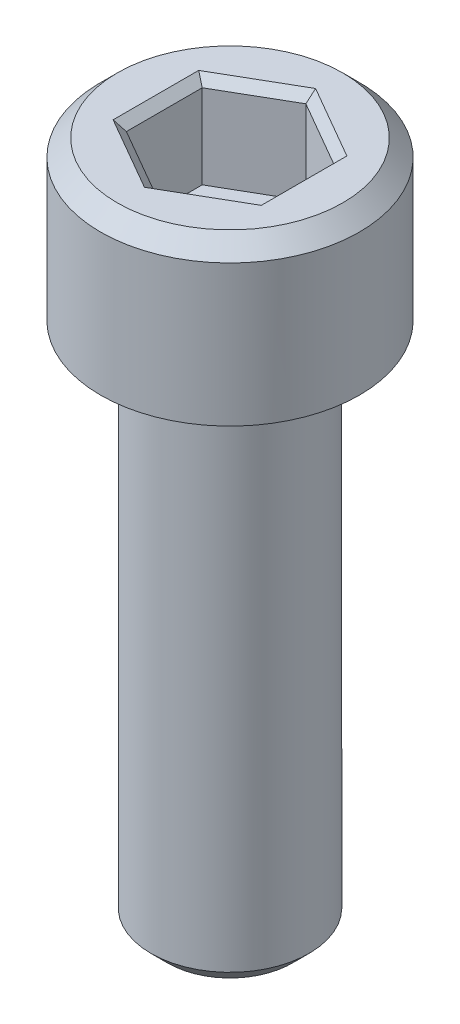
ISO-10303-21;
HEADER;
FILE_DESCRIPTION(('STEP AP214'),'2;1');
FILE_NAME('part.step','',(''),(''),'','','');
FILE_SCHEMA(('AUTOMOTIVE_DESIGN { 1 0 10303 214 1 1 1 1 }'));
ENDSEC;
DATA;
#1=APPLICATION_CONTEXT('core data for automotive mechanical design processes');
#2=APPLICATION_PROTOCOL_DEFINITION('international standard','automotive_design',2000,#1);
#3=PRODUCT_CONTEXT('',#1,'mechanical');
#4=PRODUCT('Part','Part','',(#3));
#5=PRODUCT_RELATED_PRODUCT_CATEGORY('part','',(#4));
#6=PRODUCT_DEFINITION_FORMATION('','',#4);
#7=PRODUCT_DEFINITION_CONTEXT('part definition',#1,'design');
#8=PRODUCT_DEFINITION('design','',#6,#7);
#9=PRODUCT_DEFINITION_SHAPE('','',#8);
#10=(LENGTH_UNIT() NAMED_UNIT(*) SI_UNIT(.MILLI.,.METRE.));
#11=(NAMED_UNIT(*) PLANE_ANGLE_UNIT() SI_UNIT($,.RADIAN.));
#12=(NAMED_UNIT(*) SI_UNIT($,.STERADIAN.) SOLID_ANGLE_UNIT());
#13=UNCERTAINTY_MEASURE_WITH_UNIT(LENGTH_MEASURE(1.E-05),#10,'distance_accuracy_value','');
#14=(GEOMETRIC_REPRESENTATION_CONTEXT(3) GLOBAL_UNCERTAINTY_ASSIGNED_CONTEXT((#13)) GLOBAL_UNIT_ASSIGNED_CONTEXT((#10,
#11,#12)) REPRESENTATION_CONTEXT('',''));
#15=CARTESIAN_POINT('',(0.,0.,0.));
#16=DIRECTION('',(0.,0.,1.));
#17=DIRECTION('',(1.,0.,0.));
#18=AXIS2_PLACEMENT_3D('',#15,#16,#17);
#19=CARTESIAN_POINT('',(0.,0.,0.));
#20=DIRECTION('',(0.,1.,0.));
#21=DIRECTION('',(0.,0.,1.));
#22=AXIS2_PLACEMENT_3D('',#19,#20,#21);
#23=PLANE('',#22);
#24=DIRECTION('',(0.,0.,1.));
#25=VECTOR('',#24,1.);
#26=CARTESIAN_POINT('',(2.23837500000001,0.,0.));
#27=LINE('',#26,#25);
#28=CARTESIAN_POINT('',(2.23837500000001,0.,-1.29232640879732));
#29=VERTEX_POINT('',#28);
#30=CARTESIAN_POINT('',(2.23837500000001,0.,1.29232640879733));
#31=VERTEX_POINT('',#30);
#32=EDGE_CURVE('E155',#29,#31,#27,.T.);
#33=ORIENTED_EDGE('',*,*,#32,.T.);
#34=DIRECTION('',(-0.866025403784439,0.,0.5));
#35=VECTOR('',#34,1.);
#36=CARTESIAN_POINT('',(1.11918750000001,0.,1.938489613196));
#37=LINE('',#36,#35);
#38=CARTESIAN_POINT('',(0.,0.,2.58465281759467));
#39=VERTEX_POINT('',#38);
#40=EDGE_CURVE('E158',#31,#39,#37,.T.);
#41=ORIENTED_EDGE('',*,*,#40,.T.);
#42=DIRECTION('',(-0.866025403784439,0.,-0.5));
#43=VECTOR('',#42,1.);
#44=CARTESIAN_POINT('',(-1.1191875,0.,1.938489613196));
#45=LINE('',#44,#43);
#46=CARTESIAN_POINT('',(-2.23837499999999,0.,1.29232640879733));
#47=VERTEX_POINT('',#46);
#48=EDGE_CURVE('E146',#39,#47,#45,.T.);
#49=ORIENTED_EDGE('',*,*,#48,.T.);
#50=DIRECTION('',(0.,0.,-1.));
#51=VECTOR('',#50,1.);
#52=CARTESIAN_POINT('',(-2.23837499999999,0.,0.));
#53=LINE('',#52,#51);
#54=CARTESIAN_POINT('',(-2.23837499999999,0.,-1.29232640879732));
#55=VERTEX_POINT('',#54);
#56=EDGE_CURVE('E143',#47,#55,#53,.T.);
#57=ORIENTED_EDGE('',*,*,#56,.T.);
#58=DIRECTION('',(0.866025403784438,0.,-0.5));
#59=VECTOR('',#58,1.);
#60=CARTESIAN_POINT('',(-1.11918749999999,0.,-1.93848961319599));
#61=LINE('',#60,#59);
#62=CARTESIAN_POINT('',(0.,0.,-2.58465281759465));
#63=VERTEX_POINT('',#62);
#64=EDGE_CURVE('E149',#55,#63,#61,.T.);
#65=ORIENTED_EDGE('',*,*,#64,.T.);
#66=DIRECTION('',(0.866025403784439,0.,0.5));
#67=VECTOR('',#66,1.);
#68=CARTESIAN_POINT('',(1.1191875,0.,-1.93848961319599));
#69=LINE('',#68,#67);
#70=EDGE_CURVE('E152',#63,#29,#69,.T.);
#71=ORIENTED_EDGE('',*,*,#70,.T.);
#72=EDGE_LOOP('',(#33,#41,#49,#57,#65,#71));
#73=FACE_BOUND('',#72,.T.);
#74=CARTESIAN_POINT('',(0.,0.,0.));
#75=DIRECTION('',(0.,1.,0.));
#76=DIRECTION('',(0.,0.,1.));
#77=AXIS2_PLACEMENT_3D('',#74,#75,#76);
#78=CIRCLE('',#77,3.4036);
#79=CARTESIAN_POINT('',(0.,0.,3.4036));
#80=VERTEX_POINT('',#79);
#81=EDGE_CURVE('E128',#80,#80,#78,.T.);
#82=ORIENTED_EDGE('',*,*,#81,.T.);
#83=EDGE_LOOP('',(#82));
#84=FACE_BOUND('',#83,.T.);
#85=ADVANCED_FACE('F16',(#73,#84),#23,.T.);
#86=CARTESIAN_POINT('',(0.,-4.77520000000009,0.));
#87=DIRECTION('',(0.,1.,0.));
#88=DIRECTION('',(0.,0.,1.));
#89=AXIS2_PLACEMENT_3D('',#86,#87,#88);
#90=CYLINDRICAL_SURFACE('',#89,3.9116);
#91=CARTESIAN_POINT('',(0.,-0.507999999999953,0.));
#92=DIRECTION('',(0.,1.,0.));
#93=DIRECTION('',(0.,0.,1.));
#94=AXIS2_PLACEMENT_3D('',#91,#92,#93);
#95=CIRCLE('',#94,3.9116);
#96=CARTESIAN_POINT('',(0.,-0.507999999999953,3.9116));
#97=VERTEX_POINT('',#96);
#98=EDGE_CURVE('E132',#97,#97,#95,.F.);
#99=ORIENTED_EDGE('',*,*,#98,.T.);
#100=EDGE_LOOP('',(#99));
#101=FACE_BOUND('',#100,.T.);
#102=CARTESIAN_POINT('',(0.,-4.77520000000009,0.));
#103=DIRECTION('',(0.,1.,0.));
#104=DIRECTION('',(1.,0.,0.));
#105=AXIS2_PLACEMENT_3D('',#102,#103,#104);
#106=CIRCLE('',#105,3.9116);
#107=CARTESIAN_POINT('',(3.9116,-4.77520000000009,0.));
#108=VERTEX_POINT('',#107);
#109=EDGE_CURVE('E118',#108,#108,#106,.T.);
#110=ORIENTED_EDGE('',*,*,#109,.T.);
#111=EDGE_LOOP('',(#110));
#112=FACE_BOUND('',#111,.T.);
#113=ADVANCED_FACE('F18',(#101,#112),#90,.T.);
#114=CARTESIAN_POINT('',(0.,-4.77520000000009,0.));
#115=DIRECTION('',(0.,1.,0.));
#116=DIRECTION('',(0.,0.,1.));
#117=AXIS2_PLACEMENT_3D('',#114,#115,#116);
#118=PLANE('',#117);
#119=CARTESIAN_POINT('',(0.,-4.77520000000009,0.));
#120=DIRECTION('',(0.,1.,0.));
#121=DIRECTION('',(1.,0.,0.));
#122=AXIS2_PLACEMENT_3D('',#119,#120,#121);
#123=CIRCLE('',#122,2.3876);
#124=CARTESIAN_POINT('',(2.3876,-4.77520000000009,0.));
#125=VERTEX_POINT('',#124);
#126=EDGE_CURVE('E110',#125,#125,#123,.T.);
#127=ORIENTED_EDGE('',*,*,#126,.T.);
#128=EDGE_LOOP('',(#127));
#129=FACE_BOUND('',#128,.T.);
#130=ORIENTED_EDGE('',*,*,#109,.F.);
#131=EDGE_LOOP('',(#130));
#132=FACE_BOUND('',#131,.T.);
#133=ADVANCED_FACE('F265',(#129,#132),#118,.F.);
#134=CARTESIAN_POINT('',(0.,-20.6502,0.));
#135=DIRECTION('',(0.,1.,0.));
#136=DIRECTION('',(0.,0.,1.));
#137=AXIS2_PLACEMENT_3D('',#134,#135,#136);
#138=CYLINDRICAL_SURFACE('',#137,2.3876);
#139=CARTESIAN_POINT('',(0.,-20.1422,0.));
#140=DIRECTION('',(0.,1.,0.));
#141=DIRECTION('',(0.,0.,1.));
#142=AXIS2_PLACEMENT_3D('',#139,#140,#141);
#143=CIRCLE('',#142,2.3876);
#144=CARTESIAN_POINT('',(0.,-20.1422,2.3876));
#145=VERTEX_POINT('',#144);
#146=EDGE_CURVE('E136',#145,#145,#143,.T.);
#147=ORIENTED_EDGE('',*,*,#146,.T.);
#148=EDGE_LOOP('',(#147));
#149=FACE_BOUND('',#148,.T.);
#150=ORIENTED_EDGE('',*,*,#126,.F.);
#151=EDGE_LOOP('',(#150));
#152=FACE_BOUND('',#151,.T.);
#153=ADVANCED_FACE('F268',(#149,#152),#138,.T.);
#154=CARTESIAN_POINT('',(0.,-20.6502,0.));
#155=DIRECTION('',(0.,1.,0.));
#156=DIRECTION('',(0.,0.,1.));
#157=AXIS2_PLACEMENT_3D('',#154,#155,#156);
#158=PLANE('',#157);
#159=CARTESIAN_POINT('',(0.,-20.6502,0.));
#160=DIRECTION('',(0.,1.,0.));
#161=DIRECTION('',(0.,0.,1.));
#162=AXIS2_PLACEMENT_3D('',#159,#160,#161);
#163=CIRCLE('',#162,1.8796);
#164=CARTESIAN_POINT('',(0.,-20.6502,1.8796));
#165=VERTEX_POINT('',#164);
#166=EDGE_CURVE('E140',#165,#165,#163,.F.);
#167=ORIENTED_EDGE('',*,*,#166,.T.);
#168=EDGE_LOOP('',(#167));
#169=FACE_BOUND('',#168,.T.);
#170=ADVANCED_FACE('F275',(#169),#158,.F.);
#171=CARTESIAN_POINT('',(0.,0.,0.));
#172=DIRECTION('',(0.,-1.,0.));
#173=DIRECTION('',(0.,0.,-1.));
#174=AXIS2_PLACEMENT_3D('',#171,#172,#173);
#175=CONICAL_SURFACE('',#174,3.4036,0.785398163397448);
#176=ORIENTED_EDGE('',*,*,#98,.F.);
#177=EDGE_LOOP('',(#176));
#178=FACE_BOUND('',#177,.T.);
#179=ORIENTED_EDGE('',*,*,#81,.F.);
#180=EDGE_LOOP('',(#179));
#181=FACE_BOUND('',#180,.T.);
#182=ADVANCED_FACE('F285',(#178,#181),#175,.T.);
#183=CARTESIAN_POINT('',(0.,-20.1422,0.));
#184=DIRECTION('',(0.,1.,0.));
#185=DIRECTION('',(0.,0.,1.));
#186=AXIS2_PLACEMENT_3D('',#183,#184,#185);
#187=CONICAL_SURFACE('',#186,2.3876,0.785398163397447);
#188=ORIENTED_EDGE('',*,*,#166,.F.);
#189=EDGE_LOOP('',(#188));
#190=FACE_BOUND('',#189,.T.);
#191=ORIENTED_EDGE('',*,*,#146,.F.);
#192=EDGE_LOOP('',(#191));
#193=FACE_BOUND('',#192,.T.);
#194=ADVANCED_FACE('F289',(#190,#193),#187,.T.);
#195=CARTESIAN_POINT('',(0.,-2.79399999999996,2.29135888084634));
#196=DIRECTION('',(0.5,0.,-0.866025403784438));
#197=DIRECTION('',(-0.866025403784438,0.,-0.5));
#198=AXIS2_PLACEMENT_3D('',#195,#196,#197);
#199=PLANE('',#198);
#200=DIRECTION('',(0.,1.,0.));
#201=VECTOR('',#200,1.);
#202=CARTESIAN_POINT('',(-1.984375,-2.79399999999996,1.14567944042317));
#203=LINE('',#202,#201);
#204=CARTESIAN_POINT('',(-1.984375,-2.79399999999996,1.14567944042317));
#205=VERTEX_POINT('',#204);
#206=CARTESIAN_POINT('',(-1.984375,-0.253999999999976,1.14567944042317));
#207=VERTEX_POINT('',#206);
#208=EDGE_CURVE('E101',#205,#207,#203,.T.);
#209=ORIENTED_EDGE('',*,*,#208,.T.);
#210=DIRECTION('',(0.866025403784438,0.,0.5));
#211=VECTOR('',#210,1.);
#212=CARTESIAN_POINT('',(0.,-0.253999999999976,2.29135888084634));
#213=LINE('',#212,#211);
#214=CARTESIAN_POINT('',(0.,-0.253999999999976,2.29135888084634));
#215=VERTEX_POINT('',#214);
#216=EDGE_CURVE('E25',#207,#215,#213,.T.);
#217=ORIENTED_EDGE('',*,*,#216,.T.);
#218=DIRECTION('',(0.,1.,0.));
#219=VECTOR('',#218,1.);
#220=CARTESIAN_POINT('',(0.,-2.79399999999996,2.29135888084634));
#221=LINE('',#220,#219);
#222=CARTESIAN_POINT('',(0.,-2.79399999999996,2.29135888084634));
#223=VERTEX_POINT('',#222);
#224=EDGE_CURVE('E104',#223,#215,#221,.T.);
#225=ORIENTED_EDGE('',*,*,#224,.F.);
#226=DIRECTION('',(-0.866025403784438,0.,-0.5));
#227=VECTOR('',#226,1.);
#228=CARTESIAN_POINT('',(0.,-2.79399999999996,2.29135888084634));
#229=LINE('',#228,#227);
#230=EDGE_CURVE('E93',#223,#205,#229,.T.);
#231=ORIENTED_EDGE('',*,*,#230,.T.);
#232=EDGE_LOOP('',(#209,#217,#225,#231));
#233=FACE_BOUND('',#232,.T.);
#234=ADVANCED_FACE('F100',(#233),#199,.T.);
#235=CARTESIAN_POINT('',(-1.984375,-2.79399999999996,1.14567944042317));
#236=DIRECTION('',(1.,0.,0.));
#237=DIRECTION('',(0.,0.,-1.));
#238=AXIS2_PLACEMENT_3D('',#235,#236,#237);
#239=PLANE('',#238);
#240=DIRECTION('',(0.,1.,0.));
#241=VECTOR('',#240,1.);
#242=CARTESIAN_POINT('',(-1.984375,-2.79399999999996,-1.14567944042316));
#243=LINE('',#242,#241);
#244=CARTESIAN_POINT('',(-1.984375,-2.79399999999996,-1.14567944042316));
#245=VERTEX_POINT('',#244);
#246=CARTESIAN_POINT('',(-1.984375,-0.253999999999976,-1.14567944042316));
#247=VERTEX_POINT('',#246);
#248=EDGE_CURVE('E111',#245,#247,#243,.T.);
#249=ORIENTED_EDGE('',*,*,#248,.T.);
#250=DIRECTION('',(0.,0.,1.));
#251=VECTOR('',#250,1.);
#252=CARTESIAN_POINT('',(-1.984375,-0.253999999999976,1.14567944042317));
#253=LINE('',#252,#251);
#254=EDGE_CURVE('E11',#247,#207,#253,.T.);
#255=ORIENTED_EDGE('',*,*,#254,.T.);
#256=ORIENTED_EDGE('',*,*,#208,.F.);
#257=DIRECTION('',(0.,0.,-1.));
#258=VECTOR('',#257,1.);
#259=CARTESIAN_POINT('',(-1.984375,-2.79399999999996,1.14567944042317));
#260=LINE('',#259,#258);
#261=EDGE_CURVE('E89',#205,#245,#260,.T.);
#262=ORIENTED_EDGE('',*,*,#261,.T.);
#263=EDGE_LOOP('',(#249,#255,#256,#262));
#264=FACE_BOUND('',#263,.T.);
#265=ADVANCED_FACE('F108',(#264),#239,.T.);
#266=CARTESIAN_POINT('',(-1.984375,-2.79399999999996,-1.14567944042316));
#267=DIRECTION('',(0.5,0.,0.866025403784438));
#268=DIRECTION('',(0.866025403784438,0.,-0.5));
#269=AXIS2_PLACEMENT_3D('',#266,#267,#268);
#270=PLANE('',#269);
#271=DIRECTION('',(0.,1.,0.));
#272=VECTOR('',#271,1.);
#273=CARTESIAN_POINT('',(0.,-2.79399999999996,-2.29135888084632));
#274=LINE('',#273,#272);
#275=CARTESIAN_POINT('',(0.,-2.79399999999996,-2.29135888084632));
#276=VERTEX_POINT('',#275);
#277=CARTESIAN_POINT('',(0.,-0.253999999999976,-2.29135888084632));
#278=VERTEX_POINT('',#277);
#279=EDGE_CURVE('E121',#276,#278,#274,.T.);
#280=ORIENTED_EDGE('',*,*,#279,.T.);
#281=DIRECTION('',(-0.866025403784438,0.,0.5));
#282=VECTOR('',#281,1.);
#283=CARTESIAN_POINT('',(-1.984375,-0.253999999999976,-1.14567944042316));
#284=LINE('',#283,#282);
#285=EDGE_CURVE('E38',#278,#247,#284,.T.);
#286=ORIENTED_EDGE('',*,*,#285,.T.);
#287=ORIENTED_EDGE('',*,*,#248,.F.);
#288=DIRECTION('',(0.866025403784438,0.,-0.5));
#289=VECTOR('',#288,1.);
#290=CARTESIAN_POINT('',(-1.984375,-2.79399999999996,-1.14567944042316));
#291=LINE('',#290,#289);
#292=EDGE_CURVE('E95',#245,#276,#291,.T.);
#293=ORIENTED_EDGE('',*,*,#292,.T.);
#294=EDGE_LOOP('',(#280,#286,#287,#293));
#295=FACE_BOUND('',#294,.T.);
#296=ADVANCED_FACE('F231',(#295),#270,.T.);
#297=CARTESIAN_POINT('',(0.,-2.79399999999996,-2.29135888084632));
#298=DIRECTION('',(-0.5,0.,0.866025403784438));
#299=DIRECTION('',(0.866025403784439,0.,0.5));
#300=AXIS2_PLACEMENT_3D('',#297,#298,#299);
#301=PLANE('',#300);
#302=DIRECTION('',(0.,1.,0.));
#303=VECTOR('',#302,1.);
#304=CARTESIAN_POINT('',(1.98437500000001,-2.79399999999996,-1.14567944042316));
#305=LINE('',#304,#303);
#306=CARTESIAN_POINT('',(1.98437500000001,-2.79399999999996,-1.14567944042316));
#307=VERTEX_POINT('',#306);
#308=CARTESIAN_POINT('',(1.98437500000001,-0.253999999999976,-1.14567944042316));
#309=VERTEX_POINT('',#308);
#310=EDGE_CURVE('E226',#307,#309,#305,.T.);
#311=ORIENTED_EDGE('',*,*,#310,.T.);
#312=DIRECTION('',(-0.866025403784439,0.,-0.5));
#313=VECTOR('',#312,1.);
#314=CARTESIAN_POINT('',(0.,-0.253999999999976,-2.29135888084632));
#315=LINE('',#314,#313);
#316=EDGE_CURVE('E169',#309,#278,#315,.T.);
#317=ORIENTED_EDGE('',*,*,#316,.T.);
#318=ORIENTED_EDGE('',*,*,#279,.F.);
#319=DIRECTION('',(0.866025403784439,0.,0.5));
#320=VECTOR('',#319,1.);
#321=CARTESIAN_POINT('',(0.,-2.79399999999996,-2.29135888084632));
#322=LINE('',#321,#320);
#323=EDGE_CURVE('E216',#276,#307,#322,.T.);
#324=ORIENTED_EDGE('',*,*,#323,.T.);
#325=EDGE_LOOP('',(#311,#317,#318,#324));
#326=FACE_BOUND('',#325,.T.);
#327=ADVANCED_FACE('F306',(#326),#301,.T.);
#328=CARTESIAN_POINT('',(1.98437500000001,-2.79399999999996,-1.14567944042316));
#329=DIRECTION('',(-1.,0.,0.));
#330=DIRECTION('',(0.,0.,1.));
#331=AXIS2_PLACEMENT_3D('',#328,#329,#330);
#332=PLANE('',#331);
#333=DIRECTION('',(0.,1.,0.));
#334=VECTOR('',#333,1.);
#335=CARTESIAN_POINT('',(1.98437500000001,-2.79399999999996,1.14567944042317));
#336=LINE('',#335,#334);
#337=CARTESIAN_POINT('',(1.98437500000001,-2.79399999999996,1.14567944042317));
#338=VERTEX_POINT('',#337);
#339=CARTESIAN_POINT('',(1.98437500000001,-0.253999999999976,1.14567944042317));
#340=VERTEX_POINT('',#339);
#341=EDGE_CURVE('E185',#338,#340,#336,.T.);
#342=ORIENTED_EDGE('',*,*,#341,.T.);
#343=DIRECTION('',(0.,0.,-1.));
#344=VECTOR('',#343,1.);
#345=CARTESIAN_POINT('',(1.98437500000001,-0.253999999999976,-1.14567944042316));
#346=LINE('',#345,#344);
#347=EDGE_CURVE('E166',#340,#309,#346,.T.);
#348=ORIENTED_EDGE('',*,*,#347,.T.);
#349=ORIENTED_EDGE('',*,*,#310,.F.);
#350=DIRECTION('',(0.,0.,1.));
#351=VECTOR('',#350,1.);
#352=CARTESIAN_POINT('',(1.98437500000001,-2.79399999999996,-1.14567944042316));
#353=LINE('',#352,#351);
#354=EDGE_CURVE('E219',#307,#338,#353,.T.);
#355=ORIENTED_EDGE('',*,*,#354,.T.);
#356=EDGE_LOOP('',(#342,#348,#349,#355));
#357=FACE_BOUND('',#356,.T.);
#358=ADVANCED_FACE('F309',(#357),#332,.T.);
#359=CARTESIAN_POINT('',(1.98437500000001,-2.79399999999996,1.14567944042317));
#360=DIRECTION('',(-0.5,0.,-0.866025403784438));
#361=DIRECTION('',(-0.866025403784439,0.,0.5));
#362=AXIS2_PLACEMENT_3D('',#359,#360,#361);
#363=PLANE('',#362);
#364=ORIENTED_EDGE('',*,*,#224,.T.);
#365=DIRECTION('',(0.866025403784439,0.,-0.5));
#366=VECTOR('',#365,1.);
#367=CARTESIAN_POINT('',(1.98437500000001,-0.253999999999976,1.14567944042317));
#368=LINE('',#367,#366);
#369=EDGE_CURVE('E162',#215,#340,#368,.T.);
#370=ORIENTED_EDGE('',*,*,#369,.T.);
#371=ORIENTED_EDGE('',*,*,#341,.F.);
#372=DIRECTION('',(-0.866025403784439,0.,0.5));
#373=VECTOR('',#372,1.);
#374=CARTESIAN_POINT('',(1.98437500000001,-2.79399999999996,1.14567944042317));
#375=LINE('',#374,#373);
#376=EDGE_CURVE('E184',#338,#223,#375,.T.);
#377=ORIENTED_EDGE('',*,*,#376,.T.);
#378=EDGE_LOOP('',(#364,#370,#371,#377));
#379=FACE_BOUND('',#378,.T.);
#380=ADVANCED_FACE('F181',(#379),#363,.T.);
#381=CARTESIAN_POINT('',(-3.96874999999999,-2.79399999999996,0.));
#382=DIRECTION('',(0.,-1.,0.));
#383=DIRECTION('',(0.,0.,-1.));
#384=AXIS2_PLACEMENT_3D('',#381,#382,#383);
#385=PLANE('',#384);
#386=ORIENTED_EDGE('',*,*,#230,.F.);
#387=ORIENTED_EDGE('',*,*,#376,.F.);
#388=ORIENTED_EDGE('',*,*,#354,.F.);
#389=ORIENTED_EDGE('',*,*,#323,.F.);
#390=ORIENTED_EDGE('',*,*,#292,.F.);
#391=ORIENTED_EDGE('',*,*,#261,.F.);
#392=EDGE_LOOP('',(#386,#387,#388,#389,#390,#391));
#393=FACE_BOUND('',#392,.T.);
#394=ADVANCED_FACE('F91',(#393),#385,.F.);
#395=CARTESIAN_POINT('',(-1.11918749999999,0.,-1.93848961319599));
#396=DIRECTION('',(-0.353553390593274,-0.707106781186548,-0.612372435695794));
#397=DIRECTION('',(0.,0.654653670707977,-0.755928946018455));
#398=AXIS2_PLACEMENT_3D('',#395,#396,#397);
#399=PLANE('',#398);
#400=DIRECTION('',(-0.654653670707977,0.654653670707977,-0.377964473009228));
#401=VECTOR('',#400,1.);
#402=CARTESIAN_POINT('',(-1.91860714285714,-0.319767857142939,-1.1077083503977));
#403=LINE('',#402,#401);
#404=EDGE_CURVE('E209',#247,#55,#403,.T.);
#405=ORIENTED_EDGE('',*,*,#404,.F.);
#406=ORIENTED_EDGE('',*,*,#285,.F.);
#407=DIRECTION('',(0.,0.654653670707977,-0.755928946018455));
#408=VECTOR('',#407,1.);
#409=CARTESIAN_POINT('',(0.,-0.319767857142939,-2.21541670079541));
#410=LINE('',#409,#408);
#411=EDGE_CURVE('E106',#63,#278,#410,.F.);
#412=ORIENTED_EDGE('',*,*,#411,.F.);
#413=ORIENTED_EDGE('',*,*,#64,.F.);
#414=EDGE_LOOP('',(#405,#406,#412,#413));
#415=FACE_BOUND('',#414,.T.);
#416=ADVANCED_FACE('F236',(#415),#399,.F.);
#417=CARTESIAN_POINT('',(1.1191875,0.,-1.93848961319599));
#418=DIRECTION('',(0.353553390593274,-0.707106781186548,-0.612372435695794));
#419=DIRECTION('',(0.,0.654653670707977,-0.755928946018455));
#420=AXIS2_PLACEMENT_3D('',#417,#418,#419);
#421=PLANE('',#420);
#422=ORIENTED_EDGE('',*,*,#411,.T.);
#423=ORIENTED_EDGE('',*,*,#316,.F.);
#424=DIRECTION('',(0.654653670707977,0.654653670707977,-0.377964473009228));
#425=VECTOR('',#424,1.);
#426=CARTESIAN_POINT('',(1.91860714285715,-0.319767857142939,-1.1077083503977));
#427=LINE('',#426,#425);
#428=EDGE_CURVE('E205',#29,#309,#427,.F.);
#429=ORIENTED_EDGE('',*,*,#428,.F.);
#430=ORIENTED_EDGE('',*,*,#70,.F.);
#431=EDGE_LOOP('',(#422,#423,#429,#430));
#432=FACE_BOUND('',#431,.T.);
#433=ADVANCED_FACE('F241',(#432),#421,.F.);
#434=CARTESIAN_POINT('',(-2.23837499999999,0.,0.));
#435=DIRECTION('',(-0.707106781186548,-0.707106781186548,0.));
#436=DIRECTION('',(0.707106781186548,-0.707106781186548,0.));
#437=AXIS2_PLACEMENT_3D('',#434,#435,#436);
#438=PLANE('',#437);
#439=ORIENTED_EDGE('',*,*,#404,.T.);
#440=ORIENTED_EDGE('',*,*,#56,.F.);
#441=DIRECTION('',(0.654653670707977,-0.654653670707977,-0.377964473009227));
#442=VECTOR('',#441,1.);
#443=CARTESIAN_POINT('',(-1.91860714285714,-0.319767857142939,1.10770835039772));
#444=LINE('',#443,#442);
#445=EDGE_CURVE('E200',#207,#47,#444,.F.);
#446=ORIENTED_EDGE('',*,*,#445,.F.);
#447=ORIENTED_EDGE('',*,*,#254,.F.);
#448=EDGE_LOOP('',(#439,#440,#446,#447));
#449=FACE_BOUND('',#448,.T.);
#450=ADVANCED_FACE('F248',(#449),#438,.F.);
#451=CARTESIAN_POINT('',(2.23837500000001,0.,0.));
#452=DIRECTION('',(0.707106781186548,-0.707106781186548,0.));
#453=DIRECTION('',(0.707106781186548,0.707106781186548,0.));
#454=AXIS2_PLACEMENT_3D('',#451,#452,#453);
#455=PLANE('',#454);
#456=ORIENTED_EDGE('',*,*,#428,.T.);
#457=ORIENTED_EDGE('',*,*,#347,.F.);
#458=DIRECTION('',(0.654653670707977,0.654653670707977,0.377964473009229));
#459=VECTOR('',#458,1.);
#460=CARTESIAN_POINT('',(1.91860714285715,-0.319767857142939,1.10770835039772));
#461=LINE('',#460,#459);
#462=EDGE_CURVE('E193',#31,#340,#461,.F.);
#463=ORIENTED_EDGE('',*,*,#462,.F.);
#464=ORIENTED_EDGE('',*,*,#32,.F.);
#465=EDGE_LOOP('',(#456,#457,#463,#464));
#466=FACE_BOUND('',#465,.T.);
#467=ADVANCED_FACE('F250',(#466),#455,.F.);
#468=CARTESIAN_POINT('',(-1.1191875,0.,1.938489613196));
#469=DIRECTION('',(-0.353553390593274,-0.707106781186548,0.612372435695794));
#470=DIRECTION('',(0.,-0.654653670707977,-0.755928946018455));
#471=AXIS2_PLACEMENT_3D('',#468,#469,#470);
#472=PLANE('',#471);
#473=ORIENTED_EDGE('',*,*,#445,.T.);
#474=ORIENTED_EDGE('',*,*,#48,.F.);
#475=DIRECTION('',(0.,-0.654653670707977,-0.755928946018455));
#476=VECTOR('',#475,1.);
#477=CARTESIAN_POINT('',(0.,-0.319767857142939,2.21541670079543));
#478=LINE('',#477,#476);
#479=EDGE_CURVE('E190',#215,#39,#478,.F.);
#480=ORIENTED_EDGE('',*,*,#479,.F.);
#481=ORIENTED_EDGE('',*,*,#216,.F.);
#482=EDGE_LOOP('',(#473,#474,#480,#481));
#483=FACE_BOUND('',#482,.T.);
#484=ADVANCED_FACE('F195',(#483),#472,.F.);
#485=CARTESIAN_POINT('',(1.11918750000001,0.,1.938489613196));
#486=DIRECTION('',(0.353553390593274,-0.707106781186548,0.612372435695794));
#487=DIRECTION('',(0.,-0.654653670707976,-0.755928946018455));
#488=AXIS2_PLACEMENT_3D('',#485,#486,#487);
#489=PLANE('',#488);
#490=ORIENTED_EDGE('',*,*,#462,.T.);
#491=ORIENTED_EDGE('',*,*,#369,.F.);
#492=ORIENTED_EDGE('',*,*,#479,.T.);
#493=ORIENTED_EDGE('',*,*,#40,.F.);
#494=EDGE_LOOP('',(#490,#491,#492,#493));
#495=FACE_BOUND('',#494,.T.);
#496=ADVANCED_FACE('F188',(#495),#489,.F.);
#497=CLOSED_SHELL('',(#85,#113,#133,#153,#170,#182,#194,#234,#265,#296,#327,#358,#380,#394,#416,
#433,#450,#467,#484,#496));
#498=MANIFOLD_SOLID_BREP('B1',#497);
#499=ADVANCED_BREP_SHAPE_REPRESENTATION('',(#18,#498),#14);
#500=SHAPE_DEFINITION_REPRESENTATION(#9,#499);
ENDSEC;
END-ISO-10303-21;
